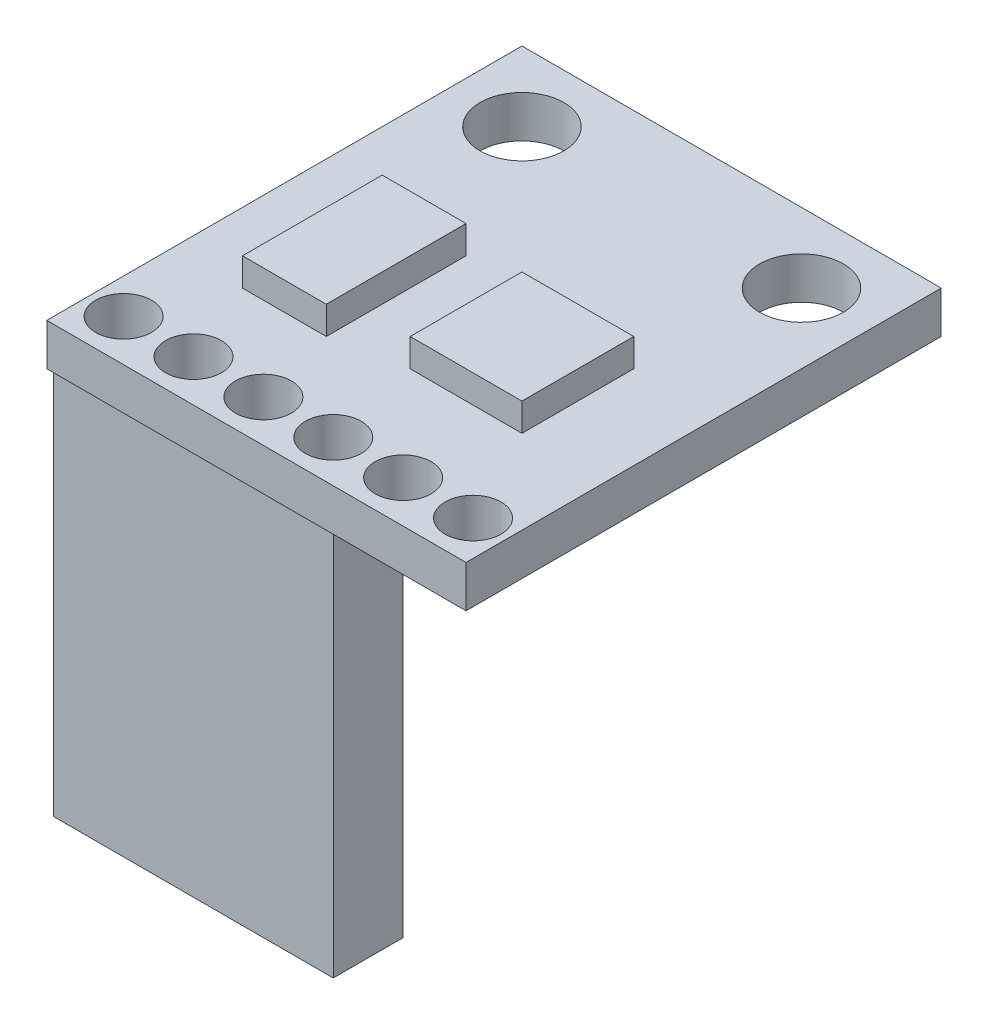
ISO-10303-21;
HEADER;
FILE_DESCRIPTION(('STEP AP214'),'2;1');
FILE_NAME('part.step','',(''),(''),'','','');
FILE_SCHEMA(('AUTOMOTIVE_DESIGN { 1 0 10303 214 1 1 1 1 }'));
ENDSEC;
DATA;
#1=APPLICATION_CONTEXT('core data for automotive mechanical design processes');
#2=APPLICATION_PROTOCOL_DEFINITION('international standard','automotive_design',2000,#1);
#3=PRODUCT_CONTEXT('',#1,'mechanical');
#4=PRODUCT('Part','Part','',(#3));
#5=PRODUCT_RELATED_PRODUCT_CATEGORY('part','',(#4));
#6=PRODUCT_DEFINITION_FORMATION('','',#4);
#7=PRODUCT_DEFINITION_CONTEXT('part definition',#1,'design');
#8=PRODUCT_DEFINITION('design','',#6,#7);
#9=PRODUCT_DEFINITION_SHAPE('','',#8);
#10=(LENGTH_UNIT() NAMED_UNIT(*) SI_UNIT(.MILLI.,.METRE.));
#11=(NAMED_UNIT(*) PLANE_ANGLE_UNIT() SI_UNIT($,.RADIAN.));
#12=(NAMED_UNIT(*) SI_UNIT($,.STERADIAN.) SOLID_ANGLE_UNIT());
#13=UNCERTAINTY_MEASURE_WITH_UNIT(LENGTH_MEASURE(1.E-05),#10,'distance_accuracy_value','');
#14=(GEOMETRIC_REPRESENTATION_CONTEXT(3) GLOBAL_UNCERTAINTY_ASSIGNED_CONTEXT((#13)) GLOBAL_UNIT_ASSIGNED_CONTEXT((#10,
#11,#12)) REPRESENTATION_CONTEXT('',''));
#15=CARTESIAN_POINT('',(0.,0.,0.));
#16=DIRECTION('',(0.,0.,1.));
#17=DIRECTION('',(1.,0.,0.));
#18=AXIS2_PLACEMENT_3D('',#15,#16,#17);
#19=CARTESIAN_POINT('',(-7.5,0.,8.5));
#20=DIRECTION('',(0.,1.,0.));
#21=DIRECTION('',(0.,0.,1.));
#22=AXIS2_PLACEMENT_3D('',#19,#20,#21);
#23=PLANE('',#22);
#24=CARTESIAN_POINT('',(6.25,0.,7.));
#25=DIRECTION('',(0.,1.,0.));
#26=DIRECTION('',(0.,0.,1.));
#27=AXIS2_PLACEMENT_3D('',#24,#25,#26);
#28=CIRCLE('',#27,1.);
#29=CARTESIAN_POINT('',(6.25,0.,8.));
#30=VERTEX_POINT('',#29);
#31=EDGE_CURVE('E247',#30,#30,#28,.T.);
#32=ORIENTED_EDGE('',*,*,#31,.T.);
#33=EDGE_LOOP('',(#32));
#34=FACE_BOUND('',#33,.T.);
#35=CARTESIAN_POINT('',(5.,0.,-6.));
#36=DIRECTION('',(0.,1.,0.));
#37=DIRECTION('',(0.,0.,1.));
#38=AXIS2_PLACEMENT_3D('',#35,#36,#37);
#39=CIRCLE('',#38,1.5);
#40=CARTESIAN_POINT('',(5.,0.,-4.5));
#41=VERTEX_POINT('',#40);
#42=EDGE_CURVE('E281',#41,#41,#39,.T.);
#43=ORIENTED_EDGE('',*,*,#42,.T.);
#44=EDGE_LOOP('',(#43));
#45=FACE_BOUND('',#44,.T.);
#46=CARTESIAN_POINT('',(-5.,0.,-6.));
#47=DIRECTION('',(0.,1.,0.));
#48=DIRECTION('',(0.,0.,1.));
#49=AXIS2_PLACEMENT_3D('',#46,#47,#48);
#50=CIRCLE('',#49,1.5);
#51=CARTESIAN_POINT('',(-5.,0.,-4.5));
#52=VERTEX_POINT('',#51);
#53=EDGE_CURVE('E287',#52,#52,#50,.T.);
#54=ORIENTED_EDGE('',*,*,#53,.T.);
#55=EDGE_LOOP('',(#54));
#56=FACE_BOUND('',#55,.T.);
#57=CARTESIAN_POINT('',(3.75,0.,7.));
#58=DIRECTION('',(0.,1.,0.));
#59=DIRECTION('',(0.,0.,1.));
#60=AXIS2_PLACEMENT_3D('',#57,#58,#59);
#61=CIRCLE('',#60,1.);
#62=CARTESIAN_POINT('',(3.75,0.,8.));
#63=VERTEX_POINT('',#62);
#64=EDGE_CURVE('E251',#63,#63,#61,.T.);
#65=ORIENTED_EDGE('',*,*,#64,.T.);
#66=EDGE_LOOP('',(#65));
#67=FACE_BOUND('',#66,.T.);
#68=DIRECTION('',(-1.,0.,0.));
#69=VECTOR('',#68,1.);
#70=CARTESIAN_POINT('',(-7.5,0.,8.25));
#71=LINE('',#70,#69);
#72=CARTESIAN_POINT('',(2.5,0.,8.25));
#73=VERTEX_POINT('',#72);
#74=CARTESIAN_POINT('',(-7.5,0.,8.25));
#75=VERTEX_POINT('',#74);
#76=EDGE_CURVE('E50',#73,#75,#71,.T.);
#77=ORIENTED_EDGE('',*,*,#76,.F.);
#78=DIRECTION('',(0.,0.,1.));
#79=VECTOR('',#78,1.);
#80=CARTESIAN_POINT('',(2.5,0.,8.25));
#81=LINE('',#80,#79);
#82=CARTESIAN_POINT('',(2.5,0.,5.75));
#83=VERTEX_POINT('',#82);
#84=EDGE_CURVE('E185',#83,#73,#81,.T.);
#85=ORIENTED_EDGE('',*,*,#84,.F.);
#86=DIRECTION('',(1.,0.,0.));
#87=VECTOR('',#86,1.);
#88=CARTESIAN_POINT('',(-7.5,0.,5.75));
#89=LINE('',#88,#87);
#90=CARTESIAN_POINT('',(-7.5,0.,5.75));
#91=VERTEX_POINT('',#90);
#92=EDGE_CURVE('E690',#91,#83,#89,.T.);
#93=ORIENTED_EDGE('',*,*,#92,.F.);
#94=DIRECTION('',(0.,0.,1.));
#95=VECTOR('',#94,1.);
#96=CARTESIAN_POINT('',(-7.5,0.,-8.5));
#97=LINE('',#96,#95);
#98=CARTESIAN_POINT('',(-7.5,0.,-8.5));
#99=VERTEX_POINT('',#98);
#100=EDGE_CURVE('E170',#99,#91,#97,.T.);
#101=ORIENTED_EDGE('',*,*,#100,.F.);
#102=DIRECTION('',(-1.,0.,0.));
#103=VECTOR('',#102,1.);
#104=CARTESIAN_POINT('',(-7.5,0.,-8.5));
#105=LINE('',#104,#103);
#106=CARTESIAN_POINT('',(7.5,0.,-8.5));
#107=VERTEX_POINT('',#106);
#108=EDGE_CURVE('E299',#107,#99,#105,.T.);
#109=ORIENTED_EDGE('',*,*,#108,.F.);
#110=DIRECTION('',(0.,0.,-1.));
#111=VECTOR('',#110,1.);
#112=CARTESIAN_POINT('',(7.5,0.,-8.5));
#113=LINE('',#112,#111);
#114=CARTESIAN_POINT('',(7.5,0.,8.5));
#115=VERTEX_POINT('',#114);
#116=EDGE_CURVE('E320',#115,#107,#113,.T.);
#117=ORIENTED_EDGE('',*,*,#116,.F.);
#118=DIRECTION('',(1.,0.,0.));
#119=VECTOR('',#118,1.);
#120=CARTESIAN_POINT('',(-7.5,0.,8.5));
#121=LINE('',#120,#119);
#122=CARTESIAN_POINT('',(-7.5,0.,8.5));
#123=VERTEX_POINT('',#122);
#124=EDGE_CURVE('E308',#123,#115,#121,.T.);
#125=ORIENTED_EDGE('',*,*,#124,.F.);
#126=EDGE_CURVE('E55',#75,#123,#97,.T.);
#127=ORIENTED_EDGE('',*,*,#126,.F.);
#128=EDGE_LOOP('',(#77,#85,#93,#101,#109,#117,#125,#127));
#129=FACE_BOUND('',#128,.T.);
#130=ADVANCED_FACE('F33',(#34,#45,#56,#67,#129),#23,.F.);
#131=CARTESIAN_POINT('',(-7.5,1.5,8.5));
#132=DIRECTION('',(0.,1.,0.));
#133=DIRECTION('',(0.,0.,1.));
#134=AXIS2_PLACEMENT_3D('',#131,#132,#133);
#135=PLANE('',#134);
#136=DIRECTION('',(1.,0.,0.));
#137=VECTOR('',#136,1.);
#138=CARTESIAN_POINT('',(-5.,1.5,4.));
#139=LINE('',#138,#137);
#140=CARTESIAN_POINT('',(-5.,1.5,4.));
#141=VERTEX_POINT('',#140);
#142=CARTESIAN_POINT('',(-2.,1.5,4.));
#143=VERTEX_POINT('',#142);
#144=EDGE_CURVE('E232',#141,#143,#139,.T.);
#145=ORIENTED_EDGE('',*,*,#144,.F.);
#146=DIRECTION('',(0.,0.,1.));
#147=VECTOR('',#146,1.);
#148=CARTESIAN_POINT('',(-5.,1.5,-1.));
#149=LINE('',#148,#147);
#150=CARTESIAN_POINT('',(-5.,1.5,-1.));
#151=VERTEX_POINT('',#150);
#152=EDGE_CURVE('E218',#151,#141,#149,.T.);
#153=ORIENTED_EDGE('',*,*,#152,.F.);
#154=DIRECTION('',(-1.,0.,0.));
#155=VECTOR('',#154,1.);
#156=CARTESIAN_POINT('',(-5.,1.5,-1.));
#157=LINE('',#156,#155);
#158=CARTESIAN_POINT('',(-2.,1.5,-1.));
#159=VERTEX_POINT('',#158);
#160=EDGE_CURVE('E223',#159,#151,#157,.T.);
#161=ORIENTED_EDGE('',*,*,#160,.F.);
#162=DIRECTION('',(0.,0.,-1.));
#163=VECTOR('',#162,1.);
#164=CARTESIAN_POINT('',(-2.,1.5,-1.));
#165=LINE('',#164,#163);
#166=EDGE_CURVE('E234',#143,#159,#165,.T.);
#167=ORIENTED_EDGE('',*,*,#166,.F.);
#168=EDGE_LOOP('',(#145,#153,#161,#167));
#169=FACE_BOUND('',#168,.T.);
#170=CARTESIAN_POINT('',(3.75,1.5,7.));
#171=DIRECTION('',(0.,1.,0.));
#172=DIRECTION('',(0.,0.,1.));
#173=AXIS2_PLACEMENT_3D('',#170,#171,#172);
#174=CIRCLE('',#173,1.);
#175=CARTESIAN_POINT('',(3.75,1.5,8.));
#176=VERTEX_POINT('',#175);
#177=EDGE_CURVE('E254',#176,#176,#174,.T.);
#178=ORIENTED_EDGE('',*,*,#177,.F.);
#179=EDGE_LOOP('',(#178));
#180=FACE_BOUND('',#179,.T.);
#181=CARTESIAN_POINT('',(-1.25,1.5,7.));
#182=DIRECTION('',(0.,1.,0.));
#183=DIRECTION('',(0.,0.,1.));
#184=AXIS2_PLACEMENT_3D('',#181,#182,#183);
#185=CIRCLE('',#184,1.);
#186=CARTESIAN_POINT('',(-1.25,1.5,8.));
#187=VERTEX_POINT('',#186);
#188=EDGE_CURVE('E266',#187,#187,#185,.T.);
#189=ORIENTED_EDGE('',*,*,#188,.F.);
#190=EDGE_LOOP('',(#189));
#191=FACE_BOUND('',#190,.T.);
#192=CARTESIAN_POINT('',(-6.25,1.5,7.));
#193=DIRECTION('',(0.,1.,0.));
#194=DIRECTION('',(0.,0.,1.));
#195=AXIS2_PLACEMENT_3D('',#192,#193,#194);
#196=CIRCLE('',#195,1.);
#197=CARTESIAN_POINT('',(-6.25,1.5,8.));
#198=VERTEX_POINT('',#197);
#199=EDGE_CURVE('E278',#198,#198,#196,.T.);
#200=ORIENTED_EDGE('',*,*,#199,.F.);
#201=EDGE_LOOP('',(#200));
#202=FACE_BOUND('',#201,.T.);
#203=CARTESIAN_POINT('',(-5.,1.5,-6.));
#204=DIRECTION('',(0.,1.,0.));
#205=DIRECTION('',(0.,0.,1.));
#206=AXIS2_PLACEMENT_3D('',#203,#204,#205);
#207=CIRCLE('',#206,1.5);
#208=CARTESIAN_POINT('',(-5.,1.5,-4.5));
#209=VERTEX_POINT('',#208);
#210=EDGE_CURVE('E290',#209,#209,#207,.T.);
#211=ORIENTED_EDGE('',*,*,#210,.F.);
#212=EDGE_LOOP('',(#211));
#213=FACE_BOUND('',#212,.T.);
#214=DIRECTION('',(0.,0.,1.));
#215=VECTOR('',#214,1.);
#216=CARTESIAN_POINT('',(-7.5,1.5,-8.5));
#217=LINE('',#216,#215);
#218=CARTESIAN_POINT('',(-7.5,1.5,-8.5));
#219=VERTEX_POINT('',#218);
#220=CARTESIAN_POINT('',(-7.5,1.5,8.5));
#221=VERTEX_POINT('',#220);
#222=EDGE_CURVE('E295',#219,#221,#217,.T.);
#223=ORIENTED_EDGE('',*,*,#222,.T.);
#224=DIRECTION('',(1.,0.,0.));
#225=VECTOR('',#224,1.);
#226=CARTESIAN_POINT('',(-7.5,1.5,8.5));
#227=LINE('',#226,#225);
#228=CARTESIAN_POINT('',(7.5,1.5,8.5));
#229=VERTEX_POINT('',#228);
#230=EDGE_CURVE('E298',#221,#229,#227,.T.);
#231=ORIENTED_EDGE('',*,*,#230,.T.);
#232=DIRECTION('',(0.,0.,-1.));
#233=VECTOR('',#232,1.);
#234=CARTESIAN_POINT('',(7.5,1.5,-8.5));
#235=LINE('',#234,#233);
#236=CARTESIAN_POINT('',(7.5,1.5,-8.5));
#237=VERTEX_POINT('',#236);
#238=EDGE_CURVE('E301',#229,#237,#235,.T.);
#239=ORIENTED_EDGE('',*,*,#238,.T.);
#240=DIRECTION('',(-1.,0.,0.));
#241=VECTOR('',#240,1.);
#242=CARTESIAN_POINT('',(-7.5,1.5,-8.5));
#243=LINE('',#242,#241);
#244=EDGE_CURVE('E303',#237,#219,#243,.T.);
#245=ORIENTED_EDGE('',*,*,#244,.T.);
#246=EDGE_LOOP('',(#223,#231,#239,#245));
#247=FACE_BOUND('',#246,.T.);
#248=CARTESIAN_POINT('',(5.,1.5,-6.));
#249=DIRECTION('',(0.,1.,0.));
#250=DIRECTION('',(0.,0.,1.));
#251=AXIS2_PLACEMENT_3D('',#248,#249,#250);
#252=CIRCLE('',#251,1.5);
#253=CARTESIAN_POINT('',(5.,1.5,-4.5));
#254=VERTEX_POINT('',#253);
#255=EDGE_CURVE('E284',#254,#254,#252,.T.);
#256=ORIENTED_EDGE('',*,*,#255,.F.);
#257=EDGE_LOOP('',(#256));
#258=FACE_BOUND('',#257,.T.);
#259=CARTESIAN_POINT('',(-3.75,1.5,7.));
#260=DIRECTION('',(0.,1.,0.));
#261=DIRECTION('',(0.,0.,1.));
#262=AXIS2_PLACEMENT_3D('',#259,#260,#261);
#263=CIRCLE('',#262,1.);
#264=CARTESIAN_POINT('',(-3.75,1.5,8.));
#265=VERTEX_POINT('',#264);
#266=EDGE_CURVE('E272',#265,#265,#263,.T.);
#267=ORIENTED_EDGE('',*,*,#266,.F.);
#268=EDGE_LOOP('',(#267));
#269=FACE_BOUND('',#268,.T.);
#270=CARTESIAN_POINT('',(1.25,1.5,7.));
#271=DIRECTION('',(0.,1.,0.));
#272=DIRECTION('',(0.,0.,1.));
#273=AXIS2_PLACEMENT_3D('',#270,#271,#272);
#274=CIRCLE('',#273,1.);
#275=CARTESIAN_POINT('',(1.25,1.5,8.));
#276=VERTEX_POINT('',#275);
#277=EDGE_CURVE('E260',#276,#276,#274,.T.);
#278=ORIENTED_EDGE('',*,*,#277,.F.);
#279=EDGE_LOOP('',(#278));
#280=FACE_BOUND('',#279,.T.);
#281=CARTESIAN_POINT('',(6.25,1.5,7.));
#282=DIRECTION('',(0.,1.,0.));
#283=DIRECTION('',(0.,0.,1.));
#284=AXIS2_PLACEMENT_3D('',#281,#282,#283);
#285=CIRCLE('',#284,1.);
#286=CARTESIAN_POINT('',(6.25,1.5,8.));
#287=VERTEX_POINT('',#286);
#288=EDGE_CURVE('E248',#287,#287,#285,.T.);
#289=ORIENTED_EDGE('',*,*,#288,.F.);
#290=EDGE_LOOP('',(#289));
#291=FACE_BOUND('',#290,.T.);
#292=DIRECTION('',(1.,0.,0.));
#293=VECTOR('',#292,1.);
#294=CARTESIAN_POINT('',(0.5,1.5,3.5));
#295=LINE('',#294,#293);
#296=CARTESIAN_POINT('',(0.5,1.5,3.5));
#297=VERTEX_POINT('',#296);
#298=CARTESIAN_POINT('',(4.5,1.5,3.5));
#299=VERTEX_POINT('',#298);
#300=EDGE_CURVE('E174',#297,#299,#295,.T.);
#301=ORIENTED_EDGE('',*,*,#300,.F.);
#302=DIRECTION('',(0.,0.,1.));
#303=VECTOR('',#302,1.);
#304=CARTESIAN_POINT('',(0.5,1.5,-0.5));
#305=LINE('',#304,#303);
#306=CARTESIAN_POINT('',(0.5,1.5,-0.5));
#307=VERTEX_POINT('',#306);
#308=EDGE_CURVE('E171',#307,#297,#305,.T.);
#309=ORIENTED_EDGE('',*,*,#308,.F.);
#310=DIRECTION('',(-1.,0.,0.));
#311=VECTOR('',#310,1.);
#312=CARTESIAN_POINT('',(0.5,1.5,-0.5));
#313=LINE('',#312,#311);
#314=CARTESIAN_POINT('',(4.5,1.5,-0.5));
#315=VERTEX_POINT('',#314);
#316=EDGE_CURVE('E197',#315,#307,#313,.T.);
#317=ORIENTED_EDGE('',*,*,#316,.F.);
#318=DIRECTION('',(0.,0.,-1.));
#319=VECTOR('',#318,1.);
#320=CARTESIAN_POINT('',(4.5,1.5,-0.5));
#321=LINE('',#320,#319);
#322=EDGE_CURVE('E205',#299,#315,#321,.T.);
#323=ORIENTED_EDGE('',*,*,#322,.F.);
#324=EDGE_LOOP('',(#301,#309,#317,#323));
#325=FACE_BOUND('',#324,.T.);
#326=ADVANCED_FACE('F337',(#169,#180,#191,#202,#213,#247,#258,#269,#280,#291,#325),#135,.T.);
#327=CARTESIAN_POINT('',(-7.5,1.5,-8.5));
#328=DIRECTION('',(1.,0.,0.));
#329=DIRECTION('',(0.,0.,-1.));
#330=AXIS2_PLACEMENT_3D('',#327,#328,#329);
#331=PLANE('',#330);
#332=ORIENTED_EDGE('',*,*,#100,.T.);
#333=DIRECTION('',(0.,1.,0.));
#334=VECTOR('',#333,1.);
#335=CARTESIAN_POINT('',(-7.5,-14.,5.75));
#336=LINE('',#335,#334);
#337=CARTESIAN_POINT('',(-7.5,-14.,5.75));
#338=VERTEX_POINT('',#337);
#339=EDGE_CURVE('E151',#338,#91,#336,.T.);
#340=ORIENTED_EDGE('',*,*,#339,.F.);
#341=DIRECTION('',(0.,0.,-1.));
#342=VECTOR('',#341,1.);
#343=CARTESIAN_POINT('',(-7.5,-14.,8.25));
#344=LINE('',#343,#342);
#345=CARTESIAN_POINT('',(-7.5,-14.,8.25));
#346=VERTEX_POINT('',#345);
#347=EDGE_CURVE('E157',#346,#338,#344,.T.);
#348=ORIENTED_EDGE('',*,*,#347,.F.);
#349=DIRECTION('',(0.,1.,0.));
#350=VECTOR('',#349,1.);
#351=CARTESIAN_POINT('',(-7.5,-14.,8.25));
#352=LINE('',#351,#350);
#353=EDGE_CURVE('E186',#346,#75,#352,.T.);
#354=ORIENTED_EDGE('',*,*,#353,.T.);
#355=ORIENTED_EDGE('',*,*,#126,.T.);
#356=DIRECTION('',(0.,-1.,0.));
#357=VECTOR('',#356,1.);
#358=CARTESIAN_POINT('',(-7.5,1.5,8.5));
#359=LINE('',#358,#357);
#360=EDGE_CURVE('E11',#221,#123,#359,.T.);
#361=ORIENTED_EDGE('',*,*,#360,.F.);
#362=ORIENTED_EDGE('',*,*,#222,.F.);
#363=DIRECTION('',(0.,-1.,0.));
#364=VECTOR('',#363,1.);
#365=CARTESIAN_POINT('',(-7.5,1.5,-8.5));
#366=LINE('',#365,#364);
#367=EDGE_CURVE('E305',#219,#99,#366,.T.);
#368=ORIENTED_EDGE('',*,*,#367,.T.);
#369=EDGE_LOOP('',(#332,#340,#348,#354,#355,#361,#362,#368));
#370=FACE_BOUND('',#369,.T.);
#371=ADVANCED_FACE('F35',(#370),#331,.F.);
#372=CARTESIAN_POINT('',(-7.5,1.5,8.5));
#373=DIRECTION('',(0.,0.,-1.));
#374=DIRECTION('',(-1.,0.,0.));
#375=AXIS2_PLACEMENT_3D('',#372,#373,#374);
#376=PLANE('',#375);
#377=ORIENTED_EDGE('',*,*,#124,.T.);
#378=DIRECTION('',(0.,-1.,0.));
#379=VECTOR('',#378,1.);
#380=CARTESIAN_POINT('',(7.5,1.5,8.5));
#381=LINE('',#380,#379);
#382=EDGE_CURVE('E42',#229,#115,#381,.T.);
#383=ORIENTED_EDGE('',*,*,#382,.F.);
#384=ORIENTED_EDGE('',*,*,#230,.F.);
#385=ORIENTED_EDGE('',*,*,#360,.T.);
#386=EDGE_LOOP('',(#377,#383,#384,#385));
#387=FACE_BOUND('',#386,.T.);
#388=ADVANCED_FACE('F326',(#387),#376,.F.);
#389=CARTESIAN_POINT('',(7.5,1.5,-8.5));
#390=DIRECTION('',(-1.,0.,0.));
#391=DIRECTION('',(0.,0.,1.));
#392=AXIS2_PLACEMENT_3D('',#389,#390,#391);
#393=PLANE('',#392);
#394=ORIENTED_EDGE('',*,*,#116,.T.);
#395=DIRECTION('',(0.,-1.,0.));
#396=VECTOR('',#395,1.);
#397=CARTESIAN_POINT('',(7.5,1.5,-8.5));
#398=LINE('',#397,#396);
#399=EDGE_CURVE('E316',#237,#107,#398,.T.);
#400=ORIENTED_EDGE('',*,*,#399,.F.);
#401=ORIENTED_EDGE('',*,*,#238,.F.);
#402=ORIENTED_EDGE('',*,*,#382,.T.);
#403=EDGE_LOOP('',(#394,#400,#401,#402));
#404=FACE_BOUND('',#403,.T.);
#405=ADVANCED_FACE('F329',(#404),#393,.F.);
#406=CARTESIAN_POINT('',(-7.5,1.5,-8.5));
#407=DIRECTION('',(0.,0.,1.));
#408=DIRECTION('',(1.,0.,0.));
#409=AXIS2_PLACEMENT_3D('',#406,#407,#408);
#410=PLANE('',#409);
#411=ORIENTED_EDGE('',*,*,#108,.T.);
#412=ORIENTED_EDGE('',*,*,#367,.F.);
#413=ORIENTED_EDGE('',*,*,#244,.F.);
#414=ORIENTED_EDGE('',*,*,#399,.T.);
#415=EDGE_LOOP('',(#411,#412,#413,#414));
#416=FACE_BOUND('',#415,.T.);
#417=ADVANCED_FACE('F333',(#416),#410,.F.);
#418=CARTESIAN_POINT('',(-5.,1.5,-6.));
#419=DIRECTION('',(0.,-1.,0.));
#420=DIRECTION('',(0.,0.,-1.));
#421=AXIS2_PLACEMENT_3D('',#418,#419,#420);
#422=CYLINDRICAL_SURFACE('',#421,1.5);
#423=ORIENTED_EDGE('',*,*,#210,.T.);
#424=EDGE_LOOP('',(#423));
#425=FACE_BOUND('',#424,.T.);
#426=ORIENTED_EDGE('',*,*,#53,.F.);
#427=EDGE_LOOP('',(#426));
#428=FACE_BOUND('',#427,.T.);
#429=ADVANCED_FACE('F389',(#425,#428),#422,.F.);
#430=CARTESIAN_POINT('',(5.,1.5,-6.));
#431=DIRECTION('',(0.,-1.,0.));
#432=DIRECTION('',(0.,0.,-1.));
#433=AXIS2_PLACEMENT_3D('',#430,#431,#432);
#434=CYLINDRICAL_SURFACE('',#433,1.5);
#435=ORIENTED_EDGE('',*,*,#255,.T.);
#436=EDGE_LOOP('',(#435));
#437=FACE_BOUND('',#436,.T.);
#438=ORIENTED_EDGE('',*,*,#42,.F.);
#439=EDGE_LOOP('',(#438));
#440=FACE_BOUND('',#439,.T.);
#441=ADVANCED_FACE('F598',(#437,#440),#434,.F.);
#442=CARTESIAN_POINT('',(-6.25,1.5,7.));
#443=DIRECTION('',(0.,-1.,0.));
#444=DIRECTION('',(0.,0.,-1.));
#445=AXIS2_PLACEMENT_3D('',#442,#443,#444);
#446=CYLINDRICAL_SURFACE('',#445,1.);
#447=ORIENTED_EDGE('',*,*,#199,.T.);
#448=EDGE_LOOP('',(#447));
#449=FACE_BOUND('',#448,.T.);
#450=CARTESIAN_POINT('',(-6.25,0.,7.));
#451=DIRECTION('',(0.,1.,0.));
#452=DIRECTION('',(0.,0.,1.));
#453=AXIS2_PLACEMENT_3D('',#450,#451,#452);
#454=CIRCLE('',#453,1.);
#455=CARTESIAN_POINT('',(-6.25,0.,8.));
#456=VERTEX_POINT('',#455);
#457=EDGE_CURVE('E275',#456,#456,#454,.T.);
#458=ORIENTED_EDGE('',*,*,#457,.F.);
#459=EDGE_LOOP('',(#458));
#460=FACE_BOUND('',#459,.T.);
#461=ADVANCED_FACE('F591',(#449,#460),#446,.F.);
#462=CARTESIAN_POINT('',(-3.75,1.5,7.));
#463=DIRECTION('',(0.,-1.,0.));
#464=DIRECTION('',(0.,0.,-1.));
#465=AXIS2_PLACEMENT_3D('',#462,#463,#464);
#466=CYLINDRICAL_SURFACE('',#465,1.);
#467=ORIENTED_EDGE('',*,*,#266,.T.);
#468=EDGE_LOOP('',(#467));
#469=FACE_BOUND('',#468,.T.);
#470=CARTESIAN_POINT('',(-3.75,0.,7.));
#471=DIRECTION('',(0.,1.,0.));
#472=DIRECTION('',(0.,0.,1.));
#473=AXIS2_PLACEMENT_3D('',#470,#471,#472);
#474=CIRCLE('',#473,1.);
#475=CARTESIAN_POINT('',(-3.75,0.,8.));
#476=VERTEX_POINT('',#475);
#477=EDGE_CURVE('E269',#476,#476,#474,.T.);
#478=ORIENTED_EDGE('',*,*,#477,.F.);
#479=EDGE_LOOP('',(#478));
#480=FACE_BOUND('',#479,.T.);
#481=ADVANCED_FACE('F581',(#469,#480),#466,.F.);
#482=CARTESIAN_POINT('',(-1.25,1.5,7.));
#483=DIRECTION('',(0.,-1.,0.));
#484=DIRECTION('',(0.,0.,-1.));
#485=AXIS2_PLACEMENT_3D('',#482,#483,#484);
#486=CYLINDRICAL_SURFACE('',#485,1.);
#487=ORIENTED_EDGE('',*,*,#188,.T.);
#488=EDGE_LOOP('',(#487));
#489=FACE_BOUND('',#488,.T.);
#490=CARTESIAN_POINT('',(-1.25,0.,7.));
#491=DIRECTION('',(0.,1.,0.));
#492=DIRECTION('',(0.,0.,1.));
#493=AXIS2_PLACEMENT_3D('',#490,#491,#492);
#494=CIRCLE('',#493,1.);
#495=CARTESIAN_POINT('',(-1.25,0.,8.));
#496=VERTEX_POINT('',#495);
#497=EDGE_CURVE('E263',#496,#496,#494,.T.);
#498=ORIENTED_EDGE('',*,*,#497,.F.);
#499=EDGE_LOOP('',(#498));
#500=FACE_BOUND('',#499,.T.);
#501=ADVANCED_FACE('F578',(#489,#500),#486,.F.);
#502=CARTESIAN_POINT('',(1.25,1.5,7.));
#503=DIRECTION('',(0.,-1.,0.));
#504=DIRECTION('',(0.,0.,-1.));
#505=AXIS2_PLACEMENT_3D('',#502,#503,#504);
#506=CYLINDRICAL_SURFACE('',#505,1.);
#507=ORIENTED_EDGE('',*,*,#277,.T.);
#508=EDGE_LOOP('',(#507));
#509=FACE_BOUND('',#508,.T.);
#510=CARTESIAN_POINT('',(1.25,0.,7.));
#511=DIRECTION('',(0.,1.,0.));
#512=DIRECTION('',(0.,0.,1.));
#513=AXIS2_PLACEMENT_3D('',#510,#511,#512);
#514=CIRCLE('',#513,1.);
#515=CARTESIAN_POINT('',(1.25,0.,8.));
#516=VERTEX_POINT('',#515);
#517=EDGE_CURVE('E257',#516,#516,#514,.T.);
#518=ORIENTED_EDGE('',*,*,#517,.F.);
#519=EDGE_LOOP('',(#518));
#520=FACE_BOUND('',#519,.T.);
#521=ADVANCED_FACE('F580',(#509,#520),#506,.F.);
#522=CARTESIAN_POINT('',(3.75,1.5,7.));
#523=DIRECTION('',(0.,-1.,0.));
#524=DIRECTION('',(0.,0.,-1.));
#525=AXIS2_PLACEMENT_3D('',#522,#523,#524);
#526=CYLINDRICAL_SURFACE('',#525,1.);
#527=ORIENTED_EDGE('',*,*,#177,.T.);
#528=EDGE_LOOP('',(#527));
#529=FACE_BOUND('',#528,.T.);
#530=ORIENTED_EDGE('',*,*,#64,.F.);
#531=EDGE_LOOP('',(#530));
#532=FACE_BOUND('',#531,.T.);
#533=ADVANCED_FACE('F588',(#529,#532),#526,.F.);
#534=CARTESIAN_POINT('',(6.25,1.5,7.));
#535=DIRECTION('',(0.,-1.,0.));
#536=DIRECTION('',(0.,0.,-1.));
#537=AXIS2_PLACEMENT_3D('',#534,#535,#536);
#538=CYLINDRICAL_SURFACE('',#537,1.);
#539=ORIENTED_EDGE('',*,*,#288,.T.);
#540=EDGE_LOOP('',(#539));
#541=FACE_BOUND('',#540,.T.);
#542=ORIENTED_EDGE('',*,*,#31,.F.);
#543=EDGE_LOOP('',(#542));
#544=FACE_BOUND('',#543,.T.);
#545=ADVANCED_FACE('F410',(#541,#544),#538,.F.);
#546=CARTESIAN_POINT('',(-5.,2.5,-1.));
#547=DIRECTION('',(1.,0.,0.));
#548=DIRECTION('',(0.,0.,-1.));
#549=AXIS2_PLACEMENT_3D('',#546,#547,#548);
#550=PLANE('',#549);
#551=ORIENTED_EDGE('',*,*,#152,.T.);
#552=DIRECTION('',(0.,-1.,0.));
#553=VECTOR('',#552,1.);
#554=CARTESIAN_POINT('',(-5.,2.5,4.));
#555=LINE('',#554,#553);
#556=CARTESIAN_POINT('',(-5.,2.5,4.));
#557=VERTEX_POINT('',#556);
#558=EDGE_CURVE('E245',#557,#141,#555,.T.);
#559=ORIENTED_EDGE('',*,*,#558,.F.);
#560=DIRECTION('',(0.,0.,1.));
#561=VECTOR('',#560,1.);
#562=CARTESIAN_POINT('',(-5.,2.5,-1.));
#563=LINE('',#562,#561);
#564=CARTESIAN_POINT('',(-5.,2.5,-1.));
#565=VERTEX_POINT('',#564);
#566=EDGE_CURVE('E219',#565,#557,#563,.T.);
#567=ORIENTED_EDGE('',*,*,#566,.F.);
#568=DIRECTION('',(0.,-1.,0.));
#569=VECTOR('',#568,1.);
#570=CARTESIAN_POINT('',(-5.,2.5,-1.));
#571=LINE('',#570,#569);
#572=EDGE_CURVE('E229',#565,#151,#571,.T.);
#573=ORIENTED_EDGE('',*,*,#572,.T.);
#574=EDGE_LOOP('',(#551,#559,#567,#573));
#575=FACE_BOUND('',#574,.T.);
#576=ADVANCED_FACE('F414',(#575),#550,.F.);
#577=CARTESIAN_POINT('',(-5.,2.5,4.));
#578=DIRECTION('',(0.,0.,-1.));
#579=DIRECTION('',(-1.,0.,0.));
#580=AXIS2_PLACEMENT_3D('',#577,#578,#579);
#581=PLANE('',#580);
#582=ORIENTED_EDGE('',*,*,#144,.T.);
#583=DIRECTION('',(0.,-1.,0.));
#584=VECTOR('',#583,1.);
#585=CARTESIAN_POINT('',(-2.,2.5,4.));
#586=LINE('',#585,#584);
#587=CARTESIAN_POINT('',(-2.,2.5,4.));
#588=VERTEX_POINT('',#587);
#589=EDGE_CURVE('E242',#588,#143,#586,.T.);
#590=ORIENTED_EDGE('',*,*,#589,.F.);
#591=DIRECTION('',(1.,0.,0.));
#592=VECTOR('',#591,1.);
#593=CARTESIAN_POINT('',(-5.,2.5,4.));
#594=LINE('',#593,#592);
#595=EDGE_CURVE('E222',#557,#588,#594,.T.);
#596=ORIENTED_EDGE('',*,*,#595,.F.);
#597=ORIENTED_EDGE('',*,*,#558,.T.);
#598=EDGE_LOOP('',(#582,#590,#596,#597));
#599=FACE_BOUND('',#598,.T.);
#600=ADVANCED_FACE('F418',(#599),#581,.F.);
#601=CARTESIAN_POINT('',(-2.,2.5,-1.));
#602=DIRECTION('',(-1.,0.,0.));
#603=DIRECTION('',(0.,0.,1.));
#604=AXIS2_PLACEMENT_3D('',#601,#602,#603);
#605=PLANE('',#604);
#606=ORIENTED_EDGE('',*,*,#166,.T.);
#607=DIRECTION('',(0.,-1.,0.));
#608=VECTOR('',#607,1.);
#609=CARTESIAN_POINT('',(-2.,2.5,-1.));
#610=LINE('',#609,#608);
#611=CARTESIAN_POINT('',(-2.,2.5,-1.));
#612=VERTEX_POINT('',#611);
#613=EDGE_CURVE('E240',#612,#159,#610,.T.);
#614=ORIENTED_EDGE('',*,*,#613,.F.);
#615=DIRECTION('',(0.,0.,-1.));
#616=VECTOR('',#615,1.);
#617=CARTESIAN_POINT('',(-2.,2.5,-1.));
#618=LINE('',#617,#616);
#619=EDGE_CURVE('E225',#588,#612,#618,.T.);
#620=ORIENTED_EDGE('',*,*,#619,.F.);
#621=ORIENTED_EDGE('',*,*,#589,.T.);
#622=EDGE_LOOP('',(#606,#614,#620,#621));
#623=FACE_BOUND('',#622,.T.);
#624=ADVANCED_FACE('F428',(#623),#605,.F.);
#625=CARTESIAN_POINT('',(-5.,2.5,-1.));
#626=DIRECTION('',(0.,0.,1.));
#627=DIRECTION('',(1.,0.,0.));
#628=AXIS2_PLACEMENT_3D('',#625,#626,#627);
#629=PLANE('',#628);
#630=ORIENTED_EDGE('',*,*,#160,.T.);
#631=ORIENTED_EDGE('',*,*,#572,.F.);
#632=DIRECTION('',(-1.,0.,0.));
#633=VECTOR('',#632,1.);
#634=CARTESIAN_POINT('',(-5.,2.5,-1.));
#635=LINE('',#634,#633);
#636=EDGE_CURVE('E227',#612,#565,#635,.T.);
#637=ORIENTED_EDGE('',*,*,#636,.F.);
#638=ORIENTED_EDGE('',*,*,#613,.T.);
#639=EDGE_LOOP('',(#630,#631,#637,#638));
#640=FACE_BOUND('',#639,.T.);
#641=ADVANCED_FACE('F438',(#640),#629,.F.);
#642=CARTESIAN_POINT('',(-5.,2.5,4.));
#643=DIRECTION('',(0.,1.,0.));
#644=DIRECTION('',(0.,0.,1.));
#645=AXIS2_PLACEMENT_3D('',#642,#643,#644);
#646=PLANE('',#645);
#647=ORIENTED_EDGE('',*,*,#566,.T.);
#648=ORIENTED_EDGE('',*,*,#595,.T.);
#649=ORIENTED_EDGE('',*,*,#619,.T.);
#650=ORIENTED_EDGE('',*,*,#636,.T.);
#651=EDGE_LOOP('',(#647,#648,#649,#650));
#652=FACE_BOUND('',#651,.T.);
#653=ADVANCED_FACE('F448',(#652),#646,.T.);
#654=CARTESIAN_POINT('',(0.5,2.5,-0.5));
#655=DIRECTION('',(1.,0.,0.));
#656=DIRECTION('',(0.,0.,-1.));
#657=AXIS2_PLACEMENT_3D('',#654,#655,#656);
#658=PLANE('',#657);
#659=ORIENTED_EDGE('',*,*,#308,.T.);
#660=DIRECTION('',(0.,-1.,0.));
#661=VECTOR('',#660,1.);
#662=CARTESIAN_POINT('',(0.5,2.5,3.5));
#663=LINE('',#662,#661);
#664=CARTESIAN_POINT('',(0.5,2.5,3.5));
#665=VERTEX_POINT('',#664);
#666=EDGE_CURVE('E216',#665,#297,#663,.T.);
#667=ORIENTED_EDGE('',*,*,#666,.F.);
#668=DIRECTION('',(0.,0.,1.));
#669=VECTOR('',#668,1.);
#670=CARTESIAN_POINT('',(0.5,2.5,-0.5));
#671=LINE('',#670,#669);
#672=CARTESIAN_POINT('',(0.5,2.5,-0.5));
#673=VERTEX_POINT('',#672);
#674=EDGE_CURVE('E193',#673,#665,#671,.T.);
#675=ORIENTED_EDGE('',*,*,#674,.F.);
#676=DIRECTION('',(0.,-1.,0.));
#677=VECTOR('',#676,1.);
#678=CARTESIAN_POINT('',(0.5,2.5,-0.5));
#679=LINE('',#678,#677);
#680=EDGE_CURVE('E202',#673,#307,#679,.T.);
#681=ORIENTED_EDGE('',*,*,#680,.T.);
#682=EDGE_LOOP('',(#659,#667,#675,#681));
#683=FACE_BOUND('',#682,.T.);
#684=ADVANCED_FACE('F368',(#683),#658,.F.);
#685=CARTESIAN_POINT('',(0.5,2.5,3.5));
#686=DIRECTION('',(0.,0.,-1.));
#687=DIRECTION('',(-1.,0.,0.));
#688=AXIS2_PLACEMENT_3D('',#685,#686,#687);
#689=PLANE('',#688);
#690=ORIENTED_EDGE('',*,*,#300,.T.);
#691=DIRECTION('',(0.,-1.,0.));
#692=VECTOR('',#691,1.);
#693=CARTESIAN_POINT('',(4.5,2.5,3.5));
#694=LINE('',#693,#692);
#695=CARTESIAN_POINT('',(4.5,2.5,3.5));
#696=VERTEX_POINT('',#695);
#697=EDGE_CURVE('E213',#696,#299,#694,.T.);
#698=ORIENTED_EDGE('',*,*,#697,.F.);
#699=DIRECTION('',(1.,0.,0.));
#700=VECTOR('',#699,1.);
#701=CARTESIAN_POINT('',(0.5,2.5,3.5));
#702=LINE('',#701,#700);
#703=EDGE_CURVE('E196',#665,#696,#702,.T.);
#704=ORIENTED_EDGE('',*,*,#703,.F.);
#705=ORIENTED_EDGE('',*,*,#666,.T.);
#706=EDGE_LOOP('',(#690,#698,#704,#705));
#707=FACE_BOUND('',#706,.T.);
#708=ADVANCED_FACE('F356',(#707),#689,.F.);
#709=CARTESIAN_POINT('',(4.5,2.5,-0.5));
#710=DIRECTION('',(-1.,0.,0.));
#711=DIRECTION('',(0.,0.,1.));
#712=AXIS2_PLACEMENT_3D('',#709,#710,#711);
#713=PLANE('',#712);
#714=ORIENTED_EDGE('',*,*,#322,.T.);
#715=DIRECTION('',(0.,-1.,0.));
#716=VECTOR('',#715,1.);
#717=CARTESIAN_POINT('',(4.5,2.5,-0.5));
#718=LINE('',#717,#716);
#719=CARTESIAN_POINT('',(4.5,2.5,-0.5));
#720=VERTEX_POINT('',#719);
#721=EDGE_CURVE('E211',#720,#315,#718,.T.);
#722=ORIENTED_EDGE('',*,*,#721,.F.);
#723=DIRECTION('',(0.,0.,-1.));
#724=VECTOR('',#723,1.);
#725=CARTESIAN_POINT('',(4.5,2.5,-0.5));
#726=LINE('',#725,#724);
#727=EDGE_CURVE('E199',#696,#720,#726,.T.);
#728=ORIENTED_EDGE('',*,*,#727,.F.);
#729=ORIENTED_EDGE('',*,*,#697,.T.);
#730=EDGE_LOOP('',(#714,#722,#728,#729));
#731=FACE_BOUND('',#730,.T.);
#732=ADVANCED_FACE('F360',(#731),#713,.F.);
#733=CARTESIAN_POINT('',(0.5,2.5,-0.5));
#734=DIRECTION('',(0.,0.,1.));
#735=DIRECTION('',(1.,0.,0.));
#736=AXIS2_PLACEMENT_3D('',#733,#734,#735);
#737=PLANE('',#736);
#738=ORIENTED_EDGE('',*,*,#316,.T.);
#739=ORIENTED_EDGE('',*,*,#680,.F.);
#740=DIRECTION('',(-1.,0.,0.));
#741=VECTOR('',#740,1.);
#742=CARTESIAN_POINT('',(0.5,2.5,-0.5));
#743=LINE('',#742,#741);
#744=EDGE_CURVE('E201',#720,#673,#743,.T.);
#745=ORIENTED_EDGE('',*,*,#744,.F.);
#746=ORIENTED_EDGE('',*,*,#721,.T.);
#747=EDGE_LOOP('',(#738,#739,#745,#746));
#748=FACE_BOUND('',#747,.T.);
#749=ADVANCED_FACE('F370',(#748),#737,.F.);
#750=CARTESIAN_POINT('',(0.5,2.5,3.5));
#751=DIRECTION('',(0.,1.,0.));
#752=DIRECTION('',(0.,0.,1.));
#753=AXIS2_PLACEMENT_3D('',#750,#751,#752);
#754=PLANE('',#753);
#755=ORIENTED_EDGE('',*,*,#674,.T.);
#756=ORIENTED_EDGE('',*,*,#703,.T.);
#757=ORIENTED_EDGE('',*,*,#727,.T.);
#758=ORIENTED_EDGE('',*,*,#744,.T.);
#759=EDGE_LOOP('',(#755,#756,#757,#758));
#760=FACE_BOUND('',#759,.T.);
#761=ADVANCED_FACE('F364',(#760),#754,.T.);
#762=CARTESIAN_POINT('',(-7.5,-14.,5.75));
#763=DIRECTION('',(0.,-1.,0.));
#764=DIRECTION('',(0.,0.,-1.));
#765=AXIS2_PLACEMENT_3D('',#762,#763,#764);
#766=PLANE('',#765);
#767=ORIENTED_EDGE('',*,*,#347,.T.);
#768=DIRECTION('',(1.,0.,0.));
#769=VECTOR('',#768,1.);
#770=CARTESIAN_POINT('',(-7.5,-14.,5.75));
#771=LINE('',#770,#769);
#772=CARTESIAN_POINT('',(2.5,-14.,5.75));
#773=VERTEX_POINT('',#772);
#774=EDGE_CURVE('E146',#338,#773,#771,.T.);
#775=ORIENTED_EDGE('',*,*,#774,.T.);
#776=DIRECTION('',(0.,0.,1.));
#777=VECTOR('',#776,1.);
#778=CARTESIAN_POINT('',(2.5,-14.,8.25));
#779=LINE('',#778,#777);
#780=CARTESIAN_POINT('',(2.5,-14.,8.25));
#781=VERTEX_POINT('',#780);
#782=EDGE_CURVE('E156',#773,#781,#779,.T.);
#783=ORIENTED_EDGE('',*,*,#782,.T.);
#784=DIRECTION('',(-1.,0.,0.));
#785=VECTOR('',#784,1.);
#786=CARTESIAN_POINT('',(-7.5,-14.,8.25));
#787=LINE('',#786,#785);
#788=EDGE_CURVE('E162',#781,#346,#787,.T.);
#789=ORIENTED_EDGE('',*,*,#788,.T.);
#790=EDGE_LOOP('',(#767,#775,#783,#789));
#791=FACE_BOUND('',#790,.T.);
#792=ADVANCED_FACE('F160',(#791),#766,.T.);
#793=CARTESIAN_POINT('',(-7.5,-14.,8.25));
#794=DIRECTION('',(0.,0.,-1.));
#795=DIRECTION('',(-1.,0.,0.));
#796=AXIS2_PLACEMENT_3D('',#793,#794,#795);
#797=PLANE('',#796);
#798=ORIENTED_EDGE('',*,*,#76,.T.);
#799=ORIENTED_EDGE('',*,*,#353,.F.);
#800=ORIENTED_EDGE('',*,*,#788,.F.);
#801=DIRECTION('',(0.,1.,0.));
#802=VECTOR('',#801,1.);
#803=CARTESIAN_POINT('',(2.5,-14.,8.25));
#804=LINE('',#803,#802);
#805=EDGE_CURVE('E176',#781,#73,#804,.T.);
#806=ORIENTED_EDGE('',*,*,#805,.T.);
#807=EDGE_LOOP('',(#798,#799,#800,#806));
#808=FACE_BOUND('',#807,.T.);
#809=ADVANCED_FACE('F509',(#808),#797,.F.);
#810=CARTESIAN_POINT('',(2.5,-14.,8.25));
#811=DIRECTION('',(-1.,0.,0.));
#812=DIRECTION('',(0.,0.,1.));
#813=AXIS2_PLACEMENT_3D('',#810,#811,#812);
#814=PLANE('',#813);
#815=ORIENTED_EDGE('',*,*,#84,.T.);
#816=ORIENTED_EDGE('',*,*,#805,.F.);
#817=ORIENTED_EDGE('',*,*,#782,.F.);
#818=DIRECTION('',(0.,1.,0.));
#819=VECTOR('',#818,1.);
#820=CARTESIAN_POINT('',(2.5,-14.,5.75));
#821=LINE('',#820,#819);
#822=EDGE_CURVE('E153',#773,#83,#821,.T.);
#823=ORIENTED_EDGE('',*,*,#822,.T.);
#824=EDGE_LOOP('',(#815,#816,#817,#823));
#825=FACE_BOUND('',#824,.T.);
#826=ADVANCED_FACE('F517',(#825),#814,.F.);
#827=CARTESIAN_POINT('',(-7.5,-14.,5.75));
#828=DIRECTION('',(0.,0.,1.));
#829=DIRECTION('',(1.,0.,0.));
#830=AXIS2_PLACEMENT_3D('',#827,#828,#829);
#831=PLANE('',#830);
#832=ORIENTED_EDGE('',*,*,#92,.T.);
#833=ORIENTED_EDGE('',*,*,#822,.F.);
#834=ORIENTED_EDGE('',*,*,#774,.F.);
#835=ORIENTED_EDGE('',*,*,#339,.T.);
#836=EDGE_LOOP('',(#832,#833,#834,#835));
#837=FACE_BOUND('',#836,.T.);
#838=ADVANCED_FACE('F149',(#837),#831,.F.);
#839=CARTESIAN_POINT('',(-7.5,0.,5.75));
#840=DIRECTION('',(0.,-1.,0.));
#841=DIRECTION('',(0.,0.,-1.));
#842=AXIS2_PLACEMENT_3D('',#839,#840,#841);
#843=PLANE('',#842);
#844=ORIENTED_EDGE('',*,*,#517,.T.);
#845=EDGE_LOOP('',(#844));
#846=FACE_BOUND('',#845,.T.);
#847=ADVANCED_FACE('F534',(#846),#843,.F.);
#848=ORIENTED_EDGE('',*,*,#477,.T.);
#849=EDGE_LOOP('',(#848));
#850=FACE_BOUND('',#849,.T.);
#851=ADVANCED_FACE('F542',(#850),#843,.F.);
#852=ORIENTED_EDGE('',*,*,#457,.T.);
#853=EDGE_LOOP('',(#852));
#854=FACE_BOUND('',#853,.T.);
#855=ADVANCED_FACE('F552',(#854),#843,.F.);
#856=ORIENTED_EDGE('',*,*,#497,.T.);
#857=EDGE_LOOP('',(#856));
#858=FACE_BOUND('',#857,.T.);
#859=ADVANCED_FACE('F545',(#858),#843,.F.);
#860=CLOSED_SHELL('',(#130,#326,#371,#388,#405,#417,#429,#441,#461,#481,#501,#521,#533,#545,
#576,#600,#624,#641,#653,#684,#708,#732,#749,#761,#792,#809,#826,#838,#847,#851,#855,#859));
#861=MANIFOLD_SOLID_BREP('B2',#860);
#862=ADVANCED_BREP_SHAPE_REPRESENTATION('',(#18,#861),#14);
#863=SHAPE_DEFINITION_REPRESENTATION(#9,#862);
ENDSEC;
END-ISO-10303-21;
